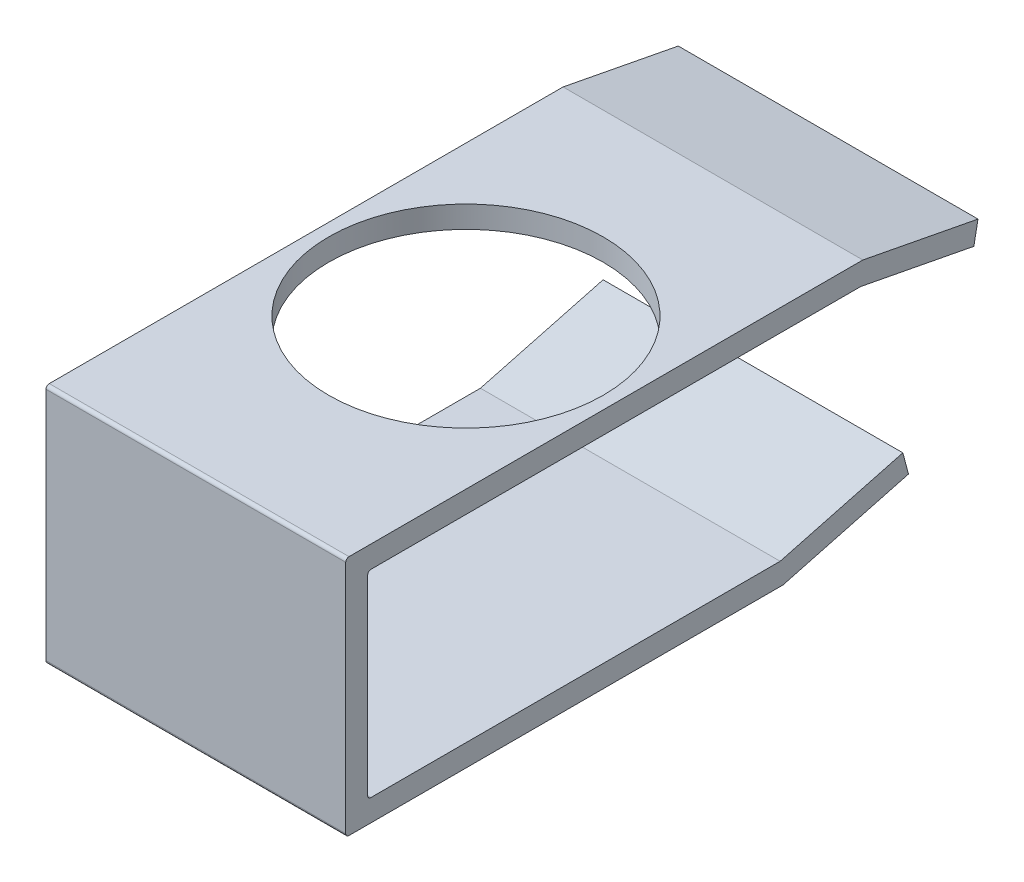
ISO-10303-21;
HEADER;
FILE_DESCRIPTION(('STEP AP214'),'2;1');
FILE_NAME('part.step','',(''),(''),'','','');
FILE_SCHEMA(('AUTOMOTIVE_DESIGN { 1 0 10303 214 1 1 1 1 }'));
ENDSEC;
DATA;
#1=APPLICATION_CONTEXT('core data for automotive mechanical design processes');
#2=APPLICATION_PROTOCOL_DEFINITION('international standard','automotive_design',2000,#1);
#3=PRODUCT_CONTEXT('',#1,'mechanical');
#4=PRODUCT('Part','Part','',(#3));
#5=PRODUCT_RELATED_PRODUCT_CATEGORY('part','',(#4));
#6=PRODUCT_DEFINITION_FORMATION('','',#4);
#7=PRODUCT_DEFINITION_CONTEXT('part definition',#1,'design');
#8=PRODUCT_DEFINITION('design','',#6,#7);
#9=PRODUCT_DEFINITION_SHAPE('','',#8);
#10=(LENGTH_UNIT() NAMED_UNIT(*) SI_UNIT(.MILLI.,.METRE.));
#11=(NAMED_UNIT(*) PLANE_ANGLE_UNIT() SI_UNIT($,.RADIAN.));
#12=(NAMED_UNIT(*) SI_UNIT($,.STERADIAN.) SOLID_ANGLE_UNIT());
#13=UNCERTAINTY_MEASURE_WITH_UNIT(LENGTH_MEASURE(1.E-05),#10,'distance_accuracy_value','');
#14=(GEOMETRIC_REPRESENTATION_CONTEXT(3) GLOBAL_UNCERTAINTY_ASSIGNED_CONTEXT((#13)) GLOBAL_UNIT_ASSIGNED_CONTEXT((#10,
#11,#12)) REPRESENTATION_CONTEXT('',''));
#15=CARTESIAN_POINT('',(0.,0.,0.));
#16=DIRECTION('',(0.,0.,1.));
#17=DIRECTION('',(1.,0.,0.));
#18=AXIS2_PLACEMENT_3D('',#15,#16,#17);
#19=CARTESIAN_POINT('',(2.73,1.89820064469806,-5.65888473936501));
#20=DIRECTION('',(0.,0.188847393650122,0.982006446980648));
#21=DIRECTION('',(0.,-0.982006446980648,0.188847393650122));
#22=AXIS2_PLACEMENT_3D('',#19,#20,#21);
#23=PLANE('',#22);
#24=DIRECTION('',(1.,0.,0.));
#25=VECTOR('',#24,1.);
#26=CARTESIAN_POINT('',(2.73,1.89820064469807,-5.65888473936501));
#27=LINE('',#26,#25);
#28=CARTESIAN_POINT('',(0.,1.89820064469806,-5.65888473936501));
#29=VERTEX_POINT('',#28);
#30=CARTESIAN_POINT('',(2.73,1.89820064469806,-5.65888473936501));
#31=VERTEX_POINT('',#30);
#32=EDGE_CURVE('E219',#29,#31,#27,.T.);
#33=ORIENTED_EDGE('',*,*,#32,.T.);
#34=DIRECTION('',(0.,-0.982006446980648,0.188847393650122));
#35=VECTOR('',#34,1.);
#36=CARTESIAN_POINT('',(2.73,1.89820064469806,-5.65888473936501));
#37=LINE('',#36,#35);
#38=CARTESIAN_POINT('',(2.73,1.70179935530194,-5.62111526063499));
#39=VERTEX_POINT('',#38);
#40=EDGE_CURVE('E246',#39,#31,#37,.F.);
#41=ORIENTED_EDGE('',*,*,#40,.F.);
#42=DIRECTION('',(1.,0.,0.));
#43=VECTOR('',#42,1.);
#44=CARTESIAN_POINT('',(2.73,1.70179935530193,-5.62111526063499));
#45=LINE('',#44,#43);
#46=CARTESIAN_POINT('',(0.,1.70179935530194,-5.62111526063499));
#47=VERTEX_POINT('',#46);
#48=EDGE_CURVE('E225',#39,#47,#45,.F.);
#49=ORIENTED_EDGE('',*,*,#48,.T.);
#50=DIRECTION('',(0.,-0.982006446980648,0.188847393650122));
#51=VECTOR('',#50,1.);
#52=CARTESIAN_POINT('',(0.,1.89820064469806,-5.65888473936501));
#53=LINE('',#52,#51);
#54=EDGE_CURVE('E238',#29,#47,#53,.T.);
#55=ORIENTED_EDGE('',*,*,#54,.F.);
#56=EDGE_LOOP('',(#33,#41,#49,#55));
#57=FACE_BOUND('',#56,.T.);
#58=ADVANCED_FACE('F15',(#57),#23,.F.);
#59=CARTESIAN_POINT('',(2.73,0.1,-3.85695167108941));
#60=DIRECTION('',(0.,-0.96651827859162,-0.256597773077421));
#61=DIRECTION('',(0.,0.256597773077421,-0.96651827859162));
#62=AXIS2_PLACEMENT_3D('',#59,#60,#61);
#63=PLANE('',#62);
#64=DIRECTION('',(1.,0.,0.));
#65=VECTOR('',#64,1.);
#66=CARTESIAN_POINT('',(2.73,0.1,-3.85695167108941));
#67=LINE('',#66,#65);
#68=CARTESIAN_POINT('',(0.,0.1,-3.85695167108941));
#69=VERTEX_POINT('',#68);
#70=CARTESIAN_POINT('',(2.73,0.1,-3.85695167108941));
#71=VERTEX_POINT('',#70);
#72=EDGE_CURVE('E186',#69,#71,#67,.T.);
#73=ORIENTED_EDGE('',*,*,#72,.T.);
#74=DIRECTION('',(0.,0.256597773077421,-0.96651827859162));
#75=VECTOR('',#74,1.);
#76=CARTESIAN_POINT('',(2.73,0.1,-3.85695167108941));
#77=LINE('',#76,#75);
#78=CARTESIAN_POINT('',(2.73,0.396651827859162,-4.97434022269226));
#79=VERTEX_POINT('',#78);
#80=EDGE_CURVE('E234',#79,#71,#77,.F.);
#81=ORIENTED_EDGE('',*,*,#80,.F.);
#82=DIRECTION('',(1.,0.,0.));
#83=VECTOR('',#82,1.);
#84=CARTESIAN_POINT('',(2.73,0.396651827859161,-4.97434022269226));
#85=LINE('',#84,#83);
#86=CARTESIAN_POINT('',(0.,0.396651827859162,-4.97434022269226));
#87=VERTEX_POINT('',#86);
#88=EDGE_CURVE('E199',#79,#87,#85,.F.);
#89=ORIENTED_EDGE('',*,*,#88,.T.);
#90=DIRECTION('',(0.,0.256597773077421,-0.96651827859162));
#91=VECTOR('',#90,1.);
#92=CARTESIAN_POINT('',(0.,0.1,-3.85695167108941));
#93=LINE('',#92,#91);
#94=EDGE_CURVE('E135',#69,#87,#93,.T.);
#95=ORIENTED_EDGE('',*,*,#94,.F.);
#96=EDGE_LOOP('',(#73,#81,#89,#95));
#97=FACE_BOUND('',#96,.T.);
#98=ADVANCED_FACE('F344',(#97),#63,.F.);
#99=CARTESIAN_POINT('',(2.73,0.13,-0.13));
#100=DIRECTION('',(-1.,0.,0.));
#101=DIRECTION('',(0.,0.,1.));
#102=AXIS2_PLACEMENT_3D('',#99,#100,#101);
#103=CYLINDRICAL_SURFACE('',#102,0.03);
#104=DIRECTION('',(1.,0.,0.));
#105=VECTOR('',#104,1.);
#106=CARTESIAN_POINT('',(2.73,0.13,-0.1));
#107=LINE('',#106,#105);
#108=CARTESIAN_POINT('',(0.,0.13,-0.1));
#109=VERTEX_POINT('',#108);
#110=CARTESIAN_POINT('',(2.73,0.13,-0.1));
#111=VERTEX_POINT('',#110);
#112=EDGE_CURVE('E137',#109,#111,#107,.T.);
#113=ORIENTED_EDGE('',*,*,#112,.T.);
#114=CARTESIAN_POINT('',(2.73,0.13,-0.13));
#115=DIRECTION('',(-1.,0.,0.));
#116=DIRECTION('',(0.,0.,1.));
#117=AXIS2_PLACEMENT_3D('',#114,#115,#116);
#118=CIRCLE('',#117,0.03);
#119=CARTESIAN_POINT('',(2.73,0.1,-0.13));
#120=VERTEX_POINT('',#119);
#121=EDGE_CURVE('E18',#120,#111,#118,.T.);
#122=ORIENTED_EDGE('',*,*,#121,.F.);
#123=DIRECTION('',(1.,0.,0.));
#124=VECTOR('',#123,1.);
#125=CARTESIAN_POINT('',(2.73,0.1,-0.13));
#126=LINE('',#125,#124);
#127=CARTESIAN_POINT('',(0.,0.1,-0.13));
#128=VERTEX_POINT('',#127);
#129=EDGE_CURVE('E143',#120,#128,#126,.F.);
#130=ORIENTED_EDGE('',*,*,#129,.T.);
#131=CARTESIAN_POINT('',(0.,0.13,-0.13));
#132=DIRECTION('',(-1.,0.,0.));
#133=DIRECTION('',(0.,0.,1.));
#134=AXIS2_PLACEMENT_3D('',#131,#132,#133);
#135=CIRCLE('',#134,0.03);
#136=EDGE_CURVE('E134',#109,#128,#135,.F.);
#137=ORIENTED_EDGE('',*,*,#136,.F.);
#138=EDGE_LOOP('',(#113,#122,#130,#137));
#139=FACE_BOUND('',#138,.T.);
#140=ADVANCED_FACE('F138',(#139),#103,.F.);
#141=CARTESIAN_POINT('',(2.73,1.87,-0.13));
#142=DIRECTION('',(-1.,0.,0.));
#143=DIRECTION('',(0.,0.,1.));
#144=AXIS2_PLACEMENT_3D('',#141,#142,#143);
#145=CYLINDRICAL_SURFACE('',#144,0.03);
#146=DIRECTION('',(1.,0.,0.));
#147=VECTOR('',#146,1.);
#148=CARTESIAN_POINT('',(2.73,1.9,-0.13));
#149=LINE('',#148,#147);
#150=CARTESIAN_POINT('',(0.,1.9,-0.13));
#151=VERTEX_POINT('',#150);
#152=CARTESIAN_POINT('',(2.73,1.9,-0.13));
#153=VERTEX_POINT('',#152);
#154=EDGE_CURVE('E176',#151,#153,#149,.T.);
#155=ORIENTED_EDGE('',*,*,#154,.T.);
#156=CARTESIAN_POINT('',(2.73,1.87,-0.13));
#157=DIRECTION('',(-1.,0.,0.));
#158=DIRECTION('',(0.,0.,1.));
#159=AXIS2_PLACEMENT_3D('',#156,#157,#158);
#160=CIRCLE('',#159,0.03);
#161=CARTESIAN_POINT('',(2.73,1.87,-0.1));
#162=VERTEX_POINT('',#161);
#163=EDGE_CURVE('E269',#162,#153,#160,.T.);
#164=ORIENTED_EDGE('',*,*,#163,.F.);
#165=DIRECTION('',(1.,0.,0.));
#166=VECTOR('',#165,1.);
#167=CARTESIAN_POINT('',(2.73,1.87,-0.1));
#168=LINE('',#167,#166);
#169=CARTESIAN_POINT('',(0.,1.87,-0.1));
#170=VERTEX_POINT('',#169);
#171=EDGE_CURVE('E142',#162,#170,#168,.F.);
#172=ORIENTED_EDGE('',*,*,#171,.T.);
#173=CARTESIAN_POINT('',(0.,1.87,-0.13));
#174=DIRECTION('',(-1.,0.,0.));
#175=DIRECTION('',(0.,0.,1.));
#176=AXIS2_PLACEMENT_3D('',#173,#174,#175);
#177=CIRCLE('',#176,0.03);
#178=EDGE_CURVE('E226',#151,#170,#177,.F.);
#179=ORIENTED_EDGE('',*,*,#178,.F.);
#180=EDGE_LOOP('',(#155,#164,#172,#179));
#181=FACE_BOUND('',#180,.T.);
#182=ADVANCED_FACE('F351',(#181),#145,.F.);
#183=CARTESIAN_POINT('',(2.73,1.9,-4.59047190820505));
#184=DIRECTION('',(0.,0.982006446980647,-0.188847393650125));
#185=DIRECTION('',(0.,0.188847393650125,0.982006446980647));
#186=AXIS2_PLACEMENT_3D('',#183,#184,#185);
#187=PLANE('',#186);
#188=ORIENTED_EDGE('',*,*,#48,.F.);
#189=DIRECTION('',(0.,0.188847393650125,0.982006446980647));
#190=VECTOR('',#189,1.);
#191=CARTESIAN_POINT('',(2.73,1.9,-4.59047190820505));
#192=LINE('',#191,#190);
#193=CARTESIAN_POINT('',(2.73,1.9,-4.59047190820505));
#194=VERTEX_POINT('',#193);
#195=EDGE_CURVE('E222',#194,#39,#192,.F.);
#196=ORIENTED_EDGE('',*,*,#195,.F.);
#197=DIRECTION('',(1.,0.,0.));
#198=VECTOR('',#197,1.);
#199=CARTESIAN_POINT('',(2.73,1.9,-4.59047190820505));
#200=LINE('',#199,#198);
#201=CARTESIAN_POINT('',(0.,1.9,-4.59047190820505));
#202=VERTEX_POINT('',#201);
#203=EDGE_CURVE('E179',#194,#202,#200,.F.);
#204=ORIENTED_EDGE('',*,*,#203,.T.);
#205=DIRECTION('',(0.,0.188847393650125,0.982006446980647));
#206=VECTOR('',#205,1.);
#207=CARTESIAN_POINT('',(0.,1.9,-4.59047190820505));
#208=LINE('',#207,#206);
#209=EDGE_CURVE('E229',#47,#202,#208,.T.);
#210=ORIENTED_EDGE('',*,*,#209,.F.);
#211=EDGE_LOOP('',(#188,#196,#204,#210));
#212=FACE_BOUND('',#211,.T.);
#213=ADVANCED_FACE('F391',(#212),#187,.F.);
#214=CARTESIAN_POINT('',(2.73,2.1,-4.60952809179495));
#215=DIRECTION('',(0.,-0.982006446980647,0.188847393650124));
#216=DIRECTION('',(0.,-0.188847393650124,-0.982006446980647));
#217=AXIS2_PLACEMENT_3D('',#214,#215,#216);
#218=PLANE('',#217);
#219=DIRECTION('',(1.,0.,0.));
#220=VECTOR('',#219,1.);
#221=CARTESIAN_POINT('',(2.73,2.1,-4.60952809179495));
#222=LINE('',#221,#220);
#223=CARTESIAN_POINT('',(0.,2.1,-4.60952809179495));
#224=VERTEX_POINT('',#223);
#225=CARTESIAN_POINT('',(2.73,2.1,-4.60952809179495));
#226=VERTEX_POINT('',#225);
#227=EDGE_CURVE('E170',#224,#226,#222,.T.);
#228=ORIENTED_EDGE('',*,*,#227,.T.);
#229=DIRECTION('',(0.,-0.188847393650124,-0.982006446980647));
#230=VECTOR('',#229,1.);
#231=CARTESIAN_POINT('',(2.73,2.1,-4.60952809179495));
#232=LINE('',#231,#230);
#233=EDGE_CURVE('E215',#31,#226,#232,.F.);
#234=ORIENTED_EDGE('',*,*,#233,.F.);
#235=ORIENTED_EDGE('',*,*,#32,.F.);
#236=DIRECTION('',(0.,-0.188847393650124,-0.982006446980647));
#237=VECTOR('',#236,1.);
#238=CARTESIAN_POINT('',(0.,2.1,-4.60952809179495));
#239=LINE('',#238,#237);
#240=EDGE_CURVE('E211',#224,#29,#239,.T.);
#241=ORIENTED_EDGE('',*,*,#240,.F.);
#242=EDGE_LOOP('',(#228,#234,#235,#241));
#243=FACE_BOUND('',#242,.T.);
#244=ADVANCED_FACE('F387',(#243),#218,.F.);
#245=CARTESIAN_POINT('',(1.365,1.8,-2.36));
#246=DIRECTION('',(0.,1.,0.));
#247=DIRECTION('',(0.,0.,1.));
#248=AXIS2_PLACEMENT_3D('',#245,#246,#247);
#249=CYLINDRICAL_SURFACE('',#248,1.25);
#250=CARTESIAN_POINT('',(1.365,2.1,-2.36));
#251=DIRECTION('',(0.,1.,0.));
#252=DIRECTION('',(0.,0.,1.));
#253=AXIS2_PLACEMENT_3D('',#250,#251,#252);
#254=CIRCLE('',#253,1.25);
#255=CARTESIAN_POINT('',(1.365,2.1,-1.11));
#256=VERTEX_POINT('',#255);
#257=EDGE_CURVE('E166',#256,#256,#254,.T.);
#258=ORIENTED_EDGE('',*,*,#257,.T.);
#259=EDGE_LOOP('',(#258));
#260=FACE_BOUND('',#259,.T.);
#261=CARTESIAN_POINT('',(1.365,1.9,-2.36));
#262=DIRECTION('',(0.,1.,0.));
#263=DIRECTION('',(0.,0.,1.));
#264=AXIS2_PLACEMENT_3D('',#261,#262,#263);
#265=CIRCLE('',#264,1.25);
#266=CARTESIAN_POINT('',(1.365,1.9,-1.11));
#267=VERTEX_POINT('',#266);
#268=EDGE_CURVE('E173',#267,#267,#265,.F.);
#269=ORIENTED_EDGE('',*,*,#268,.T.);
#270=EDGE_LOOP('',(#269));
#271=FACE_BOUND('',#270,.T.);
#272=ADVANCED_FACE('F384',(#260,#271),#249,.F.);
#273=CARTESIAN_POINT('',(2.73,2.07,0.07));
#274=DIRECTION('',(-1.,0.,0.));
#275=DIRECTION('',(0.,0.,1.));
#276=AXIS2_PLACEMENT_3D('',#273,#274,#275);
#277=CYLINDRICAL_SURFACE('',#276,0.03);
#278=CARTESIAN_POINT('',(2.73,2.07,0.07));
#279=DIRECTION('',(-1.,0.,0.));
#280=DIRECTION('',(0.,0.,1.));
#281=AXIS2_PLACEMENT_3D('',#278,#279,#280);
#282=CIRCLE('',#281,0.03);
#283=CARTESIAN_POINT('',(2.73,2.07,0.1));
#284=VERTEX_POINT('',#283);
#285=CARTESIAN_POINT('',(2.73,2.1,0.0699999999999999));
#286=VERTEX_POINT('',#285);
#287=EDGE_CURVE('E208',#284,#286,#282,.T.);
#288=ORIENTED_EDGE('',*,*,#287,.T.);
#289=DIRECTION('',(1.,0.,0.));
#290=VECTOR('',#289,1.);
#291=CARTESIAN_POINT('',(2.73,2.1,0.0699999999999998));
#292=LINE('',#291,#290);
#293=CARTESIAN_POINT('',(0.,2.1,0.0699999999999999));
#294=VERTEX_POINT('',#293);
#295=EDGE_CURVE('E167',#286,#294,#292,.F.);
#296=ORIENTED_EDGE('',*,*,#295,.T.);
#297=CARTESIAN_POINT('',(0.,2.07,0.07));
#298=DIRECTION('',(-1.,0.,0.));
#299=DIRECTION('',(0.,0.,1.));
#300=AXIS2_PLACEMENT_3D('',#297,#298,#299);
#301=CIRCLE('',#300,0.03);
#302=CARTESIAN_POINT('',(0.,2.07,0.1));
#303=VERTEX_POINT('',#302);
#304=EDGE_CURVE('E214',#294,#303,#301,.F.);
#305=ORIENTED_EDGE('',*,*,#304,.T.);
#306=DIRECTION('',(-1.,0.,0.));
#307=VECTOR('',#306,1.);
#308=CARTESIAN_POINT('',(2.73,2.07,0.1));
#309=LINE('',#308,#307);
#310=EDGE_CURVE('E163',#303,#284,#309,.F.);
#311=ORIENTED_EDGE('',*,*,#310,.T.);
#312=EDGE_LOOP('',(#288,#296,#305,#311));
#313=FACE_BOUND('',#312,.T.);
#314=ADVANCED_FACE('F322',(#313),#277,.T.);
#315=CARTESIAN_POINT('',(2.73,0.203348172140838,-5.02565977730774));
#316=DIRECTION('',(0.,-0.256597773077424,0.966518278591619));
#317=DIRECTION('',(0.,-0.966518278591619,-0.256597773077424));
#318=AXIS2_PLACEMENT_3D('',#315,#316,#317);
#319=PLANE('',#318);
#320=ORIENTED_EDGE('',*,*,#88,.F.);
#321=DIRECTION('',(0.,0.966518278591626,0.2565977730774));
#322=VECTOR('',#321,1.);
#323=CARTESIAN_POINT('',(2.73,0.203348172140838,-5.02565977730774));
#324=LINE('',#323,#322);
#325=CARTESIAN_POINT('',(2.73,0.203348172140837,-5.02565977730774));
#326=VERTEX_POINT('',#325);
#327=EDGE_CURVE('E153',#326,#79,#324,.T.);
#328=ORIENTED_EDGE('',*,*,#327,.F.);
#329=DIRECTION('',(1.,0.,0.));
#330=VECTOR('',#329,1.);
#331=CARTESIAN_POINT('',(2.73,0.203348172140836,-5.02565977730774));
#332=LINE('',#331,#330);
#333=CARTESIAN_POINT('',(0.,0.203348172140837,-5.02565977730774));
#334=VERTEX_POINT('',#333);
#335=EDGE_CURVE('E192',#326,#334,#332,.F.);
#336=ORIENTED_EDGE('',*,*,#335,.T.);
#337=DIRECTION('',(0.,-0.966518278591619,-0.256597773077424));
#338=VECTOR('',#337,1.);
#339=CARTESIAN_POINT('',(0.,0.203348172140838,-5.02565977730774));
#340=LINE('',#339,#338);
#341=EDGE_CURVE('E189',#87,#334,#340,.T.);
#342=ORIENTED_EDGE('',*,*,#341,.F.);
#343=EDGE_LOOP('',(#320,#328,#336,#342));
#344=FACE_BOUND('',#343,.T.);
#345=ADVANCED_FACE('F342',(#344),#319,.F.);
#346=CARTESIAN_POINT('',(2.73,0.1,-0.13));
#347=DIRECTION('',(0.,-1.,0.));
#348=DIRECTION('',(0.,0.,-1.));
#349=AXIS2_PLACEMENT_3D('',#346,#347,#348);
#350=PLANE('',#349);
#351=ORIENTED_EDGE('',*,*,#129,.F.);
#352=DIRECTION('',(0.,0.,-1.));
#353=VECTOR('',#352,1.);
#354=CARTESIAN_POINT('',(2.73,0.1,0.07));
#355=LINE('',#354,#353);
#356=EDGE_CURVE('E133',#71,#120,#355,.F.);
#357=ORIENTED_EDGE('',*,*,#356,.F.);
#358=ORIENTED_EDGE('',*,*,#72,.F.);
#359=DIRECTION('',(0.,0.,-1.));
#360=VECTOR('',#359,1.);
#361=CARTESIAN_POINT('',(0.,0.1,0.07));
#362=LINE('',#361,#360);
#363=EDGE_CURVE('E274',#69,#128,#362,.F.);
#364=ORIENTED_EDGE('',*,*,#363,.T.);
#365=EDGE_LOOP('',(#351,#357,#358,#364));
#366=FACE_BOUND('',#365,.T.);
#367=ADVANCED_FACE('F278',(#366),#350,.F.);
#368=CARTESIAN_POINT('',(2.73,0.13,-0.1));
#369=DIRECTION('',(0.,0.,1.));
#370=DIRECTION('',(1.,0.,0.));
#371=AXIS2_PLACEMENT_3D('',#368,#369,#370);
#372=PLANE('',#371);
#373=ORIENTED_EDGE('',*,*,#171,.F.);
#374=DIRECTION('',(0.,1.,0.));
#375=VECTOR('',#374,1.);
#376=CARTESIAN_POINT('',(2.73,-0.07,-0.1));
#377=LINE('',#376,#375);
#378=EDGE_CURVE('E131',#111,#162,#377,.T.);
#379=ORIENTED_EDGE('',*,*,#378,.F.);
#380=ORIENTED_EDGE('',*,*,#112,.F.);
#381=DIRECTION('',(0.,1.,0.));
#382=VECTOR('',#381,1.);
#383=CARTESIAN_POINT('',(0.,-0.07,-0.1));
#384=LINE('',#383,#382);
#385=EDGE_CURVE('E275',#109,#170,#384,.T.);
#386=ORIENTED_EDGE('',*,*,#385,.T.);
#387=EDGE_LOOP('',(#373,#379,#380,#386));
#388=FACE_BOUND('',#387,.T.);
#389=ADVANCED_FACE('F146',(#388),#372,.F.);
#390=CARTESIAN_POINT('',(2.73,1.9,-0.13));
#391=DIRECTION('',(0.,1.,0.));
#392=DIRECTION('',(0.,0.,1.));
#393=AXIS2_PLACEMENT_3D('',#390,#391,#392);
#394=PLANE('',#393);
#395=ORIENTED_EDGE('',*,*,#268,.F.);
#396=EDGE_LOOP('',(#395));
#397=FACE_BOUND('',#396,.T.);
#398=ORIENTED_EDGE('',*,*,#203,.F.);
#399=DIRECTION('',(0.,0.,-1.));
#400=VECTOR('',#399,1.);
#401=CARTESIAN_POINT('',(2.73,1.9,0.07));
#402=LINE('',#401,#400);
#403=EDGE_CURVE('E148',#153,#194,#402,.T.);
#404=ORIENTED_EDGE('',*,*,#403,.F.);
#405=ORIENTED_EDGE('',*,*,#154,.F.);
#406=DIRECTION('',(0.,0.,-1.));
#407=VECTOR('',#406,1.);
#408=CARTESIAN_POINT('',(0.,1.9,0.07));
#409=LINE('',#408,#407);
#410=EDGE_CURVE('E280',#151,#202,#409,.T.);
#411=ORIENTED_EDGE('',*,*,#410,.T.);
#412=EDGE_LOOP('',(#398,#404,#405,#411));
#413=FACE_BOUND('',#412,.T.);
#414=ADVANCED_FACE('F371',(#397,#413),#394,.F.);
#415=CARTESIAN_POINT('',(2.73,2.1,0.0699999999999998));
#416=DIRECTION('',(0.,-1.,0.));
#417=DIRECTION('',(0.,0.,-1.));
#418=AXIS2_PLACEMENT_3D('',#415,#416,#417);
#419=PLANE('',#418);
#420=ORIENTED_EDGE('',*,*,#257,.F.);
#421=EDGE_LOOP('',(#420));
#422=FACE_BOUND('',#421,.T.);
#423=ORIENTED_EDGE('',*,*,#295,.F.);
#424=DIRECTION('',(0.,0.,-1.));
#425=VECTOR('',#424,1.);
#426=CARTESIAN_POINT('',(2.73,2.1,0.07));
#427=LINE('',#426,#425);
#428=EDGE_CURVE('E151',#226,#286,#427,.F.);
#429=ORIENTED_EDGE('',*,*,#428,.F.);
#430=ORIENTED_EDGE('',*,*,#227,.F.);
#431=DIRECTION('',(0.,0.,-1.));
#432=VECTOR('',#431,1.);
#433=CARTESIAN_POINT('',(0.,2.1,0.07));
#434=LINE('',#433,#432);
#435=EDGE_CURVE('E320',#224,#294,#434,.F.);
#436=ORIENTED_EDGE('',*,*,#435,.T.);
#437=EDGE_LOOP('',(#423,#429,#430,#436));
#438=FACE_BOUND('',#437,.T.);
#439=ADVANCED_FACE('F317',(#422,#438),#419,.F.);
#440=CARTESIAN_POINT('',(2.73,-0.0699999999999998,0.1));
#441=DIRECTION('',(0.,0.,-1.));
#442=DIRECTION('',(-1.,0.,0.));
#443=AXIS2_PLACEMENT_3D('',#440,#441,#442);
#444=PLANE('',#443);
#445=DIRECTION('',(-1.,0.,0.));
#446=VECTOR('',#445,1.);
#447=CARTESIAN_POINT('',(2.73,-0.07,0.1));
#448=LINE('',#447,#446);
#449=CARTESIAN_POINT('',(2.73,-0.07,0.1));
#450=VERTEX_POINT('',#449);
#451=CARTESIAN_POINT('',(0.,-0.07,0.1));
#452=VERTEX_POINT('',#451);
#453=EDGE_CURVE('E160',#450,#452,#448,.T.);
#454=ORIENTED_EDGE('',*,*,#453,.F.);
#455=DIRECTION('',(0.,1.,0.));
#456=VECTOR('',#455,1.);
#457=CARTESIAN_POINT('',(2.73,-0.07,0.1));
#458=LINE('',#457,#456);
#459=EDGE_CURVE('E300',#284,#450,#458,.F.);
#460=ORIENTED_EDGE('',*,*,#459,.F.);
#461=ORIENTED_EDGE('',*,*,#310,.F.);
#462=DIRECTION('',(0.,1.,0.));
#463=VECTOR('',#462,1.);
#464=CARTESIAN_POINT('',(0.,-0.07,0.1));
#465=LINE('',#464,#463);
#466=EDGE_CURVE('E260',#303,#452,#465,.F.);
#467=ORIENTED_EDGE('',*,*,#466,.T.);
#468=EDGE_LOOP('',(#454,#460,#461,#467));
#469=FACE_BOUND('',#468,.T.);
#470=ADVANCED_FACE('F327',(#469),#444,.F.);
#471=CARTESIAN_POINT('',(2.73,-0.07,0.07));
#472=DIRECTION('',(-1.,0.,0.));
#473=DIRECTION('',(0.,0.,1.));
#474=AXIS2_PLACEMENT_3D('',#471,#472,#473);
#475=CYLINDRICAL_SURFACE('',#474,0.03);
#476=CARTESIAN_POINT('',(2.73,-0.07,0.07));
#477=DIRECTION('',(-1.,0.,0.));
#478=DIRECTION('',(0.,0.,1.));
#479=AXIS2_PLACEMENT_3D('',#476,#477,#478);
#480=CIRCLE('',#479,0.03);
#481=CARTESIAN_POINT('',(2.73,-0.1,0.0699999999999999));
#482=VERTEX_POINT('',#481);
#483=EDGE_CURVE('E162',#450,#482,#480,.F.);
#484=ORIENTED_EDGE('',*,*,#483,.F.);
#485=ORIENTED_EDGE('',*,*,#453,.T.);
#486=CARTESIAN_POINT('',(0.,-0.07,0.07));
#487=DIRECTION('',(-1.,0.,0.));
#488=DIRECTION('',(0.,0.,1.));
#489=AXIS2_PLACEMENT_3D('',#486,#487,#488);
#490=CIRCLE('',#489,0.03);
#491=CARTESIAN_POINT('',(0.,-0.1,0.0699999999999999));
#492=VERTEX_POINT('',#491);
#493=EDGE_CURVE('E256',#452,#492,#490,.F.);
#494=ORIENTED_EDGE('',*,*,#493,.T.);
#495=DIRECTION('',(1.,0.,0.));
#496=VECTOR('',#495,1.);
#497=CARTESIAN_POINT('',(2.73,-0.1,0.0699999999999998));
#498=LINE('',#497,#496);
#499=EDGE_CURVE('E259',#492,#482,#498,.T.);
#500=ORIENTED_EDGE('',*,*,#499,.T.);
#501=EDGE_LOOP('',(#484,#485,#494,#500));
#502=FACE_BOUND('',#501,.T.);
#503=ADVANCED_FACE('F331',(#502),#475,.T.);
#504=CARTESIAN_POINT('',(2.73,-0.07,0.07));
#505=DIRECTION('',(1.,0.,0.));
#506=DIRECTION('',(0.,0.,-1.));
#507=AXIS2_PLACEMENT_3D('',#504,#505,#506);
#508=PLANE('',#507);
#509=ORIENTED_EDGE('',*,*,#287,.F.);
#510=ORIENTED_EDGE('',*,*,#459,.T.);
#511=ORIENTED_EDGE('',*,*,#483,.T.);
#512=DIRECTION('',(0.,0.,1.));
#513=VECTOR('',#512,1.);
#514=CARTESIAN_POINT('',(2.73,-0.1,0.0699999999999998));
#515=LINE('',#514,#513);
#516=CARTESIAN_POINT('',(2.73,-0.1,-3.88304832891059));
#517=VERTEX_POINT('',#516);
#518=EDGE_CURVE('E288',#482,#517,#515,.F.);
#519=ORIENTED_EDGE('',*,*,#518,.T.);
#520=DIRECTION('',(0.,-0.256597773077421,0.96651827859162));
#521=VECTOR('',#520,1.);
#522=CARTESIAN_POINT('',(2.73,-0.1,-3.88304832891059));
#523=LINE('',#522,#521);
#524=EDGE_CURVE('E195',#517,#326,#523,.F.);
#525=ORIENTED_EDGE('',*,*,#524,.T.);
#526=ORIENTED_EDGE('',*,*,#327,.T.);
#527=ORIENTED_EDGE('',*,*,#80,.T.);
#528=ORIENTED_EDGE('',*,*,#356,.T.);
#529=ORIENTED_EDGE('',*,*,#121,.T.);
#530=ORIENTED_EDGE('',*,*,#378,.T.);
#531=ORIENTED_EDGE('',*,*,#163,.T.);
#532=ORIENTED_EDGE('',*,*,#403,.T.);
#533=ORIENTED_EDGE('',*,*,#195,.T.);
#534=ORIENTED_EDGE('',*,*,#40,.T.);
#535=ORIENTED_EDGE('',*,*,#233,.T.);
#536=ORIENTED_EDGE('',*,*,#428,.T.);
#537=EDGE_LOOP('',(#509,#510,#511,#519,#525,#526,#527,#528,#529,#530,#531,#532,#533,#534,#535,#536));
#538=FACE_BOUND('',#537,.T.);
#539=ADVANCED_FACE('F129',(#538),#508,.T.);
#540=CARTESIAN_POINT('',(2.73,-0.1,-3.88304832891059));
#541=DIRECTION('',(0.,0.96651827859162,0.256597773077421));
#542=DIRECTION('',(0.,-0.256597773077421,0.96651827859162));
#543=AXIS2_PLACEMENT_3D('',#540,#541,#542);
#544=PLANE('',#543);
#545=ORIENTED_EDGE('',*,*,#335,.F.);
#546=ORIENTED_EDGE('',*,*,#524,.F.);
#547=DIRECTION('',(1.,0.,0.));
#548=VECTOR('',#547,1.);
#549=CARTESIAN_POINT('',(2.73,-0.1,-3.88304832891059));
#550=LINE('',#549,#548);
#551=CARTESIAN_POINT('',(0.,-0.0999999999999992,-3.8830483289106));
#552=VERTEX_POINT('',#551);
#553=EDGE_CURVE('E24',#517,#552,#550,.F.);
#554=ORIENTED_EDGE('',*,*,#553,.T.);
#555=DIRECTION('',(0.,0.256597773077423,-0.966518278591619));
#556=VECTOR('',#555,1.);
#557=CARTESIAN_POINT('',(0.,-0.1,-3.88304832891059));
#558=LINE('',#557,#556);
#559=EDGE_CURVE('E32',#552,#334,#558,.T.);
#560=ORIENTED_EDGE('',*,*,#559,.T.);
#561=EDGE_LOOP('',(#545,#546,#554,#560));
#562=FACE_BOUND('',#561,.T.);
#563=ADVANCED_FACE('F338',(#562),#544,.F.);
#564=CARTESIAN_POINT('',(0.,-0.07,0.07));
#565=DIRECTION('',(1.,0.,0.));
#566=DIRECTION('',(0.,0.,-1.));
#567=AXIS2_PLACEMENT_3D('',#564,#565,#566);
#568=PLANE('',#567);
#569=ORIENTED_EDGE('',*,*,#466,.F.);
#570=ORIENTED_EDGE('',*,*,#304,.F.);
#571=ORIENTED_EDGE('',*,*,#435,.F.);
#572=ORIENTED_EDGE('',*,*,#240,.T.);
#573=ORIENTED_EDGE('',*,*,#54,.T.);
#574=ORIENTED_EDGE('',*,*,#209,.T.);
#575=ORIENTED_EDGE('',*,*,#410,.F.);
#576=ORIENTED_EDGE('',*,*,#178,.T.);
#577=ORIENTED_EDGE('',*,*,#385,.F.);
#578=ORIENTED_EDGE('',*,*,#136,.T.);
#579=ORIENTED_EDGE('',*,*,#363,.F.);
#580=ORIENTED_EDGE('',*,*,#94,.T.);
#581=ORIENTED_EDGE('',*,*,#341,.T.);
#582=ORIENTED_EDGE('',*,*,#559,.F.);
#583=DIRECTION('',(0.,0.,1.));
#584=VECTOR('',#583,1.);
#585=CARTESIAN_POINT('',(0.,-0.1,0.0699999999999998));
#586=LINE('',#585,#584);
#587=EDGE_CURVE('E10',#552,#492,#586,.T.);
#588=ORIENTED_EDGE('',*,*,#587,.T.);
#589=ORIENTED_EDGE('',*,*,#493,.F.);
#590=EDGE_LOOP('',(#569,#570,#571,#572,#573,#574,#575,#576,#577,#578,#579,#580,#581,#582,#588,#589));
#591=FACE_BOUND('',#590,.T.);
#592=ADVANCED_FACE('F272',(#591),#568,.F.);
#593=CARTESIAN_POINT('',(2.73,-0.1,0.0699999999999998));
#594=DIRECTION('',(0.,1.,0.));
#595=DIRECTION('',(0.,0.,1.));
#596=AXIS2_PLACEMENT_3D('',#593,#594,#595);
#597=PLANE('',#596);
#598=ORIENTED_EDGE('',*,*,#553,.F.);
#599=ORIENTED_EDGE('',*,*,#518,.F.);
#600=ORIENTED_EDGE('',*,*,#499,.F.);
#601=ORIENTED_EDGE('',*,*,#587,.F.);
#602=EDGE_LOOP('',(#598,#599,#600,#601));
#603=FACE_BOUND('',#602,.T.);
#604=ADVANCED_FACE('F335',(#603),#597,.F.);
#605=CLOSED_SHELL('',(#58,#98,#140,#182,#213,#244,#272,#314,#345,#367,#389,#414,#439,#470,#503,
#539,#563,#592,#604));
#606=MANIFOLD_SOLID_BREP('B1',#605);
#607=ADVANCED_BREP_SHAPE_REPRESENTATION('',(#18,#606),#14);
#608=SHAPE_DEFINITION_REPRESENTATION(#9,#607);
ENDSEC;
END-ISO-10303-21;
